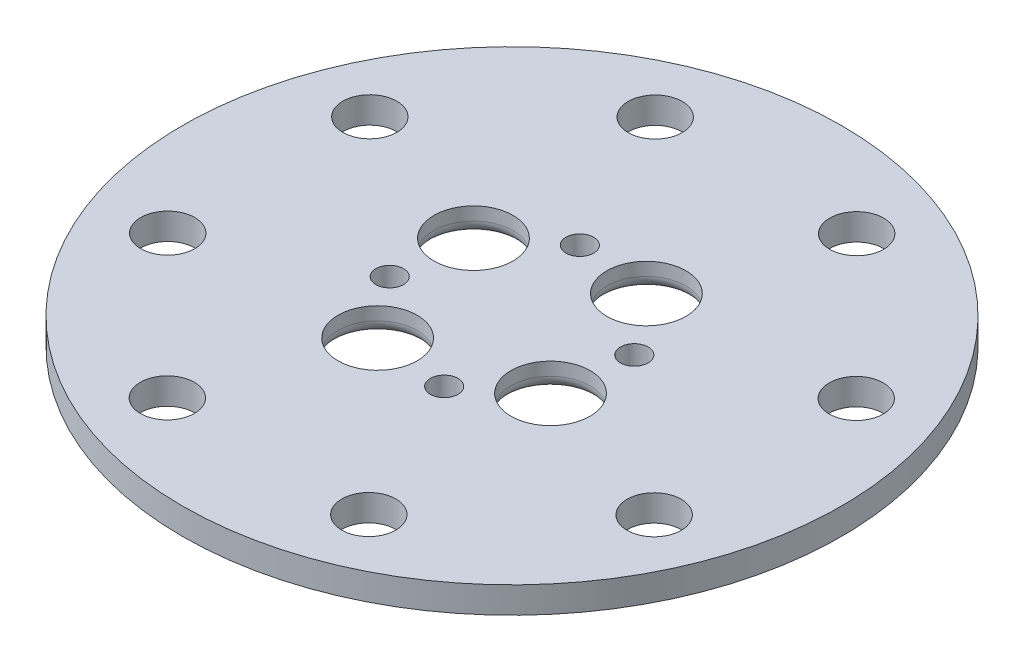
ISO-10303-21;
HEADER;
FILE_DESCRIPTION(('STEP AP214'),'2;1');
FILE_NAME('part.step','',(''),(''),'','','');
FILE_SCHEMA(('AUTOMOTIVE_DESIGN { 1 0 10303 214 1 1 1 1 }'));
ENDSEC;
DATA;
#1=APPLICATION_CONTEXT('core data for automotive mechanical design processes');
#2=APPLICATION_PROTOCOL_DEFINITION('international standard','automotive_design',2000,#1);
#3=PRODUCT_CONTEXT('',#1,'mechanical');
#4=PRODUCT('Part','Part','',(#3));
#5=PRODUCT_RELATED_PRODUCT_CATEGORY('part','',(#4));
#6=PRODUCT_DEFINITION_FORMATION('','',#4);
#7=PRODUCT_DEFINITION_CONTEXT('part definition',#1,'design');
#8=PRODUCT_DEFINITION('design','',#6,#7);
#9=PRODUCT_DEFINITION_SHAPE('','',#8);
#10=(LENGTH_UNIT() NAMED_UNIT(*) SI_UNIT(.MILLI.,.METRE.));
#11=(NAMED_UNIT(*) PLANE_ANGLE_UNIT() SI_UNIT($,.RADIAN.));
#12=(NAMED_UNIT(*) SI_UNIT($,.STERADIAN.) SOLID_ANGLE_UNIT());
#13=UNCERTAINTY_MEASURE_WITH_UNIT(LENGTH_MEASURE(1.E-05),#10,'distance_accuracy_value','');
#14=(GEOMETRIC_REPRESENTATION_CONTEXT(3) GLOBAL_UNCERTAINTY_ASSIGNED_CONTEXT((#13)) GLOBAL_UNIT_ASSIGNED_CONTEXT((#10,
#11,#12)) REPRESENTATION_CONTEXT('',''));
#15=CARTESIAN_POINT('',(0.,0.,0.));
#16=DIRECTION('',(0.,0.,1.));
#17=DIRECTION('',(1.,0.,0.));
#18=AXIS2_PLACEMENT_3D('',#15,#16,#17);
#19=CARTESIAN_POINT('',(0.,2.,0.));
#20=DIRECTION('',(0.,-1.,0.));
#21=DIRECTION('',(0.,0.,-1.));
#22=AXIS2_PLACEMENT_3D('',#19,#20,#21);
#23=CYLINDRICAL_SURFACE('',#22,25.);
#24=CARTESIAN_POINT('',(0.,2.,0.));
#25=DIRECTION('',(0.,1.,0.));
#26=DIRECTION('',(0.,0.,1.));
#27=AXIS2_PLACEMENT_3D('',#24,#25,#26);
#28=CIRCLE('',#27,25.);
#29=CARTESIAN_POINT('',(0.,2.,25.));
#30=VERTEX_POINT('',#29);
#31=EDGE_CURVE('E76',#30,#30,#28,.T.);
#32=ORIENTED_EDGE('',*,*,#31,.F.);
#33=EDGE_LOOP('',(#32));
#34=FACE_BOUND('',#33,.T.);
#35=CARTESIAN_POINT('',(0.,0.,0.));
#36=DIRECTION('',(0.,1.,0.));
#37=DIRECTION('',(0.,0.,1.));
#38=AXIS2_PLACEMENT_3D('',#35,#36,#37);
#39=CIRCLE('',#38,25.);
#40=CARTESIAN_POINT('',(0.,0.,25.));
#41=VERTEX_POINT('',#40);
#42=EDGE_CURVE('E77',#41,#41,#39,.T.);
#43=ORIENTED_EDGE('',*,*,#42,.T.);
#44=EDGE_LOOP('',(#43));
#45=FACE_BOUND('',#44,.T.);
#46=ADVANCED_FACE('F36',(#34,#45),#23,.T.);
#47=CARTESIAN_POINT('',(0.,2.,0.));
#48=DIRECTION('',(0.,1.,0.));
#49=DIRECTION('',(0.,0.,1.));
#50=AXIS2_PLACEMENT_3D('',#47,#48,#49);
#51=PLANE('',#50);
#52=CARTESIAN_POINT('',(-7.68064256948644,2.,18.4663946053315));
#53=DIRECTION('',(0.,-1.,0.));
#54=DIRECTION('',(0.,0.,-1.));
#55=AXIS2_PLACEMENT_3D('',#52,#53,#54);
#56=CIRCLE('',#55,2.05);
#57=CARTESIAN_POINT('',(-7.68064256948644,2.,16.4163946053315));
#58=VERTEX_POINT('',#57);
#59=EDGE_CURVE('E137',#58,#58,#56,.T.);
#60=ORIENTED_EDGE('',*,*,#59,.T.);
#61=EDGE_LOOP('',(#60));
#62=FACE_BOUND('',#61,.T.);
#63=CARTESIAN_POINT('',(7.62667840474221,2.,18.488747294251));
#64=DIRECTION('',(0.,-1.,0.));
#65=DIRECTION('',(0.,0.,-1.));
#66=AXIS2_PLACEMENT_3D('',#63,#64,#65);
#67=CIRCLE('',#66,2.05);
#68=CARTESIAN_POINT('',(7.62667840474221,2.,16.438747294251));
#69=VERTEX_POINT('',#68);
#70=EDGE_CURVE('E162',#69,#69,#67,.T.);
#71=ORIENTED_EDGE('',*,*,#70,.T.);
#72=EDGE_LOOP('',(#71));
#73=FACE_BOUND('',#72,.T.);
#74=CARTESIAN_POINT('',(18.4663946053311,2.,7.68064256948754));
#75=DIRECTION('',(0.,-1.,0.));
#76=DIRECTION('',(0.,0.,-1.));
#77=AXIS2_PLACEMENT_3D('',#74,#75,#76);
#78=CIRCLE('',#77,2.05);
#79=CARTESIAN_POINT('',(18.4663946053311,2.,5.63064256948754));
#80=VERTEX_POINT('',#79);
#81=EDGE_CURVE('E154',#80,#80,#78,.T.);
#82=ORIENTED_EDGE('',*,*,#81,.T.);
#83=EDGE_LOOP('',(#82));
#84=FACE_BOUND('',#83,.T.);
#85=CARTESIAN_POINT('',(18.4887472942505,2.,-7.62667840474111));
#86=DIRECTION('',(0.,-1.,0.));
#87=DIRECTION('',(0.,0.,-1.));
#88=AXIS2_PLACEMENT_3D('',#85,#86,#87);
#89=CIRCLE('',#88,2.05);
#90=CARTESIAN_POINT('',(18.4887472942505,2.,-9.67667840474111));
#91=VERTEX_POINT('',#90);
#92=EDGE_CURVE('E145',#91,#91,#89,.T.);
#93=ORIENTED_EDGE('',*,*,#92,.T.);
#94=EDGE_LOOP('',(#93));
#95=FACE_BOUND('',#94,.T.);
#96=CARTESIAN_POINT('',(7.6806425694871,2.,-18.46639460533));
#97=DIRECTION('',(0.,-1.,0.));
#98=DIRECTION('',(0.,0.,-1.));
#99=AXIS2_PLACEMENT_3D('',#96,#97,#98);
#100=CIRCLE('',#99,2.05);
#101=CARTESIAN_POINT('',(7.6806425694871,2.,-20.51639460533));
#102=VERTEX_POINT('',#101);
#103=EDGE_CURVE('E146',#102,#102,#100,.T.);
#104=ORIENTED_EDGE('',*,*,#103,.T.);
#105=EDGE_LOOP('',(#104));
#106=FACE_BOUND('',#105,.T.);
#107=CARTESIAN_POINT('',(-7.62667840474155,2.,-18.4887472942494));
#108=DIRECTION('',(0.,-1.,0.));
#109=DIRECTION('',(0.,0.,-1.));
#110=AXIS2_PLACEMENT_3D('',#107,#108,#109);
#111=CIRCLE('',#110,2.05);
#112=CARTESIAN_POINT('',(-7.62667840474155,2.,-20.5387472942494));
#113=VERTEX_POINT('',#112);
#114=EDGE_CURVE('E185',#113,#113,#111,.T.);
#115=ORIENTED_EDGE('',*,*,#114,.T.);
#116=EDGE_LOOP('',(#115));
#117=FACE_BOUND('',#116,.T.);
#118=CARTESIAN_POINT('',(-18.4663946053304,2.,-7.68064256948599));
#119=DIRECTION('',(0.,-1.,0.));
#120=DIRECTION('',(0.,0.,-1.));
#121=AXIS2_PLACEMENT_3D('',#118,#119,#120);
#122=CIRCLE('',#121,2.05);
#123=CARTESIAN_POINT('',(-18.4663946053304,2.,-9.73064256948599));
#124=VERTEX_POINT('',#123);
#125=EDGE_CURVE('E177',#124,#124,#122,.T.);
#126=ORIENTED_EDGE('',*,*,#125,.T.);
#127=EDGE_LOOP('',(#126));
#128=FACE_BOUND('',#127,.T.);
#129=CARTESIAN_POINT('',(-18.4887472942499,2.,7.62667840474266));
#130=DIRECTION('',(0.,-1.,0.));
#131=DIRECTION('',(0.,0.,-1.));
#132=AXIS2_PLACEMENT_3D('',#129,#130,#131);
#133=CIRCLE('',#132,2.05);
#134=CARTESIAN_POINT('',(-18.4887472942499,2.,5.57667840474266));
#135=VERTEX_POINT('',#134);
#136=EDGE_CURVE('E126',#135,#135,#133,.T.);
#137=ORIENTED_EDGE('',*,*,#136,.T.);
#138=EDGE_LOOP('',(#137));
#139=FACE_BOUND('',#138,.T.);
#140=CARTESIAN_POINT('',(-7.20972393812874,2.,2.06636897382066));
#141=DIRECTION('',(0.,1.,0.));
#142=DIRECTION('',(0.,0.,1.));
#143=AXIS2_PLACEMENT_3D('',#140,#141,#142);
#144=CIRCLE('',#143,1.05);
#145=CARTESIAN_POINT('',(-7.20972393812874,2.,3.11636897382066));
#146=VERTEX_POINT('',#145);
#147=EDGE_CURVE('E105',#146,#146,#144,.T.);
#148=ORIENTED_EDGE('',*,*,#147,.F.);
#149=EDGE_LOOP('',(#148));
#150=FACE_BOUND('',#149,.T.);
#151=CARTESIAN_POINT('',(2.06636897382105,2.,7.20972393812896));
#152=DIRECTION('',(0.,1.,0.));
#153=DIRECTION('',(0.,0.,1.));
#154=AXIS2_PLACEMENT_3D('',#151,#152,#153);
#155=CIRCLE('',#154,1.05);
#156=CARTESIAN_POINT('',(2.06636897382105,2.,8.25972393812896));
#157=VERTEX_POINT('',#156);
#158=EDGE_CURVE('E114',#157,#157,#155,.T.);
#159=ORIENTED_EDGE('',*,*,#158,.F.);
#160=EDGE_LOOP('',(#159));
#161=FACE_BOUND('',#160,.T.);
#162=CARTESIAN_POINT('',(7.20972393812935,2.,-2.06636897382083));
#163=DIRECTION('',(0.,1.,0.));
#164=DIRECTION('',(0.,0.,1.));
#165=AXIS2_PLACEMENT_3D('',#162,#163,#164);
#166=CIRCLE('',#165,1.05);
#167=CARTESIAN_POINT('',(7.20972393812935,2.,-1.01636897382083));
#168=VERTEX_POINT('',#167);
#169=EDGE_CURVE('E93',#168,#168,#166,.T.);
#170=ORIENTED_EDGE('',*,*,#169,.F.);
#171=EDGE_LOOP('',(#170));
#172=FACE_BOUND('',#171,.T.);
#173=CARTESIAN_POINT('',(-3.63690117331162,2.,6.55918820095631));
#174=DIRECTION('',(0.,1.,0.));
#175=DIRECTION('',(0.,0.,1.));
#176=AXIS2_PLACEMENT_3D('',#173,#174,#175);
#177=CIRCLE('',#176,3.);
#178=CARTESIAN_POINT('',(-3.63690117331162,2.,9.55918820095631));
#179=VERTEX_POINT('',#178);
#180=EDGE_CURVE('E89',#179,#179,#177,.T.);
#181=ORIENTED_EDGE('',*,*,#180,.F.);
#182=EDGE_LOOP('',(#181));
#183=FACE_BOUND('',#182,.T.);
#184=CARTESIAN_POINT('',(-6.5591882009563,2.,-3.63690117331165));
#185=DIRECTION('',(0.,1.,0.));
#186=DIRECTION('',(0.,0.,1.));
#187=AXIS2_PLACEMENT_3D('',#184,#185,#186);
#188=CIRCLE('',#187,3.);
#189=CARTESIAN_POINT('',(-6.5591882009563,2.,-0.636901173311649));
#190=VERTEX_POINT('',#189);
#191=EDGE_CURVE('E110',#190,#190,#188,.T.);
#192=ORIENTED_EDGE('',*,*,#191,.F.);
#193=EDGE_LOOP('',(#192));
#194=FACE_BOUND('',#193,.T.);
#195=CARTESIAN_POINT('',(3.63690117331167,2.,-6.55918820095629));
#196=DIRECTION('',(0.,1.,0.));
#197=DIRECTION('',(0.,0.,1.));
#198=AXIS2_PLACEMENT_3D('',#195,#196,#197);
#199=CIRCLE('',#198,3.);
#200=CARTESIAN_POINT('',(3.63690117331167,2.,-3.55918820095629));
#201=VERTEX_POINT('',#200);
#202=EDGE_CURVE('E125',#201,#201,#199,.T.);
#203=ORIENTED_EDGE('',*,*,#202,.F.);
#204=EDGE_LOOP('',(#203));
#205=FACE_BOUND('',#204,.T.);
#206=CARTESIAN_POINT('',(6.55918820095628,2.,3.63690117331169));
#207=DIRECTION('',(0.,1.,0.));
#208=DIRECTION('',(0.,0.,1.));
#209=AXIS2_PLACEMENT_3D('',#206,#207,#208);
#210=CIRCLE('',#209,3.);
#211=CARTESIAN_POINT('',(6.55918820095628,2.,6.63690117331169));
#212=VERTEX_POINT('',#211);
#213=EDGE_CURVE('E121',#212,#212,#210,.T.);
#214=ORIENTED_EDGE('',*,*,#213,.F.);
#215=EDGE_LOOP('',(#214));
#216=FACE_BOUND('',#215,.T.);
#217=CARTESIAN_POINT('',(-2.06636897382044,2.,-7.20972393812913));
#218=DIRECTION('',(0.,1.,0.));
#219=DIRECTION('',(0.,0.,1.));
#220=AXIS2_PLACEMENT_3D('',#217,#218,#219);
#221=CIRCLE('',#220,1.05);
#222=CARTESIAN_POINT('',(-2.06636897382044,2.,-6.15972393812913));
#223=VERTEX_POINT('',#222);
#224=EDGE_CURVE('E85',#223,#223,#221,.T.);
#225=ORIENTED_EDGE('',*,*,#224,.F.);
#226=EDGE_LOOP('',(#225));
#227=FACE_BOUND('',#226,.T.);
#228=ORIENTED_EDGE('',*,*,#31,.T.);
#229=EDGE_LOOP('',(#228));
#230=FACE_BOUND('',#229,.T.);
#231=ADVANCED_FACE('F197',(#62,#73,#84,#95,#106,#117,#128,#139,#150,#161,#172,#183,#194,#205,
#216,#227,#230),#51,.T.);
#232=CARTESIAN_POINT('',(0.,0.,0.));
#233=DIRECTION('',(0.,1.,0.));
#234=DIRECTION('',(0.,0.,1.));
#235=AXIS2_PLACEMENT_3D('',#232,#233,#234);
#236=PLANE('',#235);
#237=CARTESIAN_POINT('',(-7.68064256948644,0.,18.4663946053315));
#238=DIRECTION('',(0.,-1.,0.));
#239=DIRECTION('',(0.,0.,-1.));
#240=AXIS2_PLACEMENT_3D('',#237,#238,#239);
#241=CIRCLE('',#240,2.05);
#242=CARTESIAN_POINT('',(-7.68064256948644,0.,16.4163946053315));
#243=VERTEX_POINT('',#242);
#244=EDGE_CURVE('E166',#243,#243,#241,.T.);
#245=ORIENTED_EDGE('',*,*,#244,.F.);
#246=EDGE_LOOP('',(#245));
#247=FACE_BOUND('',#246,.T.);
#248=CARTESIAN_POINT('',(7.62667840474221,0.,18.488747294251));
#249=DIRECTION('',(0.,-1.,0.));
#250=DIRECTION('',(0.,0.,-1.));
#251=AXIS2_PLACEMENT_3D('',#248,#249,#250);
#252=CIRCLE('',#251,2.05);
#253=CARTESIAN_POINT('',(7.62667840474221,0.,16.438747294251));
#254=VERTEX_POINT('',#253);
#255=EDGE_CURVE('E158',#254,#254,#252,.T.);
#256=ORIENTED_EDGE('',*,*,#255,.F.);
#257=EDGE_LOOP('',(#256));
#258=FACE_BOUND('',#257,.T.);
#259=CARTESIAN_POINT('',(18.4663946053311,0.,7.68064256948754));
#260=DIRECTION('',(0.,-1.,0.));
#261=DIRECTION('',(0.,0.,-1.));
#262=AXIS2_PLACEMENT_3D('',#259,#260,#261);
#263=CIRCLE('',#262,2.05);
#264=CARTESIAN_POINT('',(18.4663946053311,0.,5.63064256948754));
#265=VERTEX_POINT('',#264);
#266=EDGE_CURVE('E150',#265,#265,#263,.T.);
#267=ORIENTED_EDGE('',*,*,#266,.F.);
#268=EDGE_LOOP('',(#267));
#269=FACE_BOUND('',#268,.T.);
#270=CARTESIAN_POINT('',(18.4887472942505,0.,-7.62667840474111));
#271=DIRECTION('',(0.,-1.,0.));
#272=DIRECTION('',(0.,0.,-1.));
#273=AXIS2_PLACEMENT_3D('',#270,#271,#272);
#274=CIRCLE('',#273,2.05);
#275=CARTESIAN_POINT('',(18.4887472942505,0.,-9.67667840474111));
#276=VERTEX_POINT('',#275);
#277=EDGE_CURVE('E141',#276,#276,#274,.T.);
#278=ORIENTED_EDGE('',*,*,#277,.F.);
#279=EDGE_LOOP('',(#278));
#280=FACE_BOUND('',#279,.T.);
#281=CARTESIAN_POINT('',(7.6806425694871,0.,-18.46639460533));
#282=DIRECTION('',(0.,-1.,0.));
#283=DIRECTION('',(0.,0.,-1.));
#284=AXIS2_PLACEMENT_3D('',#281,#282,#283);
#285=CIRCLE('',#284,2.05);
#286=CARTESIAN_POINT('',(7.6806425694871,0.,-20.51639460533));
#287=VERTEX_POINT('',#286);
#288=EDGE_CURVE('E189',#287,#287,#285,.T.);
#289=ORIENTED_EDGE('',*,*,#288,.F.);
#290=EDGE_LOOP('',(#289));
#291=FACE_BOUND('',#290,.T.);
#292=CARTESIAN_POINT('',(-7.62667840474155,0.,-18.4887472942494));
#293=DIRECTION('',(0.,-1.,0.));
#294=DIRECTION('',(0.,0.,-1.));
#295=AXIS2_PLACEMENT_3D('',#292,#293,#294);
#296=CIRCLE('',#295,2.05);
#297=CARTESIAN_POINT('',(-7.62667840474155,0.,-20.5387472942494));
#298=VERTEX_POINT('',#297);
#299=EDGE_CURVE('E181',#298,#298,#296,.T.);
#300=ORIENTED_EDGE('',*,*,#299,.F.);
#301=EDGE_LOOP('',(#300));
#302=FACE_BOUND('',#301,.T.);
#303=CARTESIAN_POINT('',(-18.4663946053304,0.,-7.68064256948599));
#304=DIRECTION('',(0.,-1.,0.));
#305=DIRECTION('',(0.,0.,-1.));
#306=AXIS2_PLACEMENT_3D('',#303,#304,#305);
#307=CIRCLE('',#306,2.05);
#308=CARTESIAN_POINT('',(-18.4663946053304,0.,-9.73064256948599));
#309=VERTEX_POINT('',#308);
#310=EDGE_CURVE('E173',#309,#309,#307,.T.);
#311=ORIENTED_EDGE('',*,*,#310,.F.);
#312=EDGE_LOOP('',(#311));
#313=FACE_BOUND('',#312,.T.);
#314=CARTESIAN_POINT('',(-18.4887472942499,0.,7.62667840474266));
#315=DIRECTION('',(0.,-1.,0.));
#316=DIRECTION('',(0.,0.,-1.));
#317=AXIS2_PLACEMENT_3D('',#314,#315,#316);
#318=CIRCLE('',#317,2.05);
#319=CARTESIAN_POINT('',(-18.4887472942499,0.,5.57667840474266));
#320=VERTEX_POINT('',#319);
#321=EDGE_CURVE('E133',#320,#320,#318,.T.);
#322=ORIENTED_EDGE('',*,*,#321,.F.);
#323=EDGE_LOOP('',(#322));
#324=FACE_BOUND('',#323,.T.);
#325=CARTESIAN_POINT('',(-6.5591882009563,0.,-3.63690117331165));
#326=DIRECTION('',(0.,1.,0.));
#327=DIRECTION('',(0.,0.,1.));
#328=AXIS2_PLACEMENT_3D('',#325,#326,#327);
#329=CIRCLE('',#328,4.);
#330=CARTESIAN_POINT('',(-6.5591882009563,0.,0.363098826688352));
#331=VERTEX_POINT('',#330);
#332=EDGE_CURVE('E60',#331,#331,#329,.T.);
#333=ORIENTED_EDGE('',*,*,#332,.T.);
#334=EDGE_LOOP('',(#333));
#335=FACE_BOUND('',#334,.T.);
#336=CARTESIAN_POINT('',(3.63690117331167,0.,-6.55918820095629));
#337=DIRECTION('',(0.,1.,0.));
#338=DIRECTION('',(0.,0.,1.));
#339=AXIS2_PLACEMENT_3D('',#336,#337,#338);
#340=CIRCLE('',#339,4.);
#341=CARTESIAN_POINT('',(3.63690117331167,0.,-2.55918820095629));
#342=VERTEX_POINT('',#341);
#343=EDGE_CURVE('E64',#342,#342,#340,.T.);
#344=ORIENTED_EDGE('',*,*,#343,.T.);
#345=EDGE_LOOP('',(#344));
#346=FACE_BOUND('',#345,.T.);
#347=CARTESIAN_POINT('',(6.55918820095628,0.,3.63690117331169));
#348=DIRECTION('',(0.,1.,0.));
#349=DIRECTION('',(0.,0.,1.));
#350=AXIS2_PLACEMENT_3D('',#347,#348,#349);
#351=CIRCLE('',#350,4.);
#352=CARTESIAN_POINT('',(6.55918820095628,0.,7.63690117331169));
#353=VERTEX_POINT('',#352);
#354=EDGE_CURVE('E68',#353,#353,#351,.T.);
#355=ORIENTED_EDGE('',*,*,#354,.T.);
#356=EDGE_LOOP('',(#355));
#357=FACE_BOUND('',#356,.T.);
#358=CARTESIAN_POINT('',(-3.63690117331162,0.,6.55918820095631));
#359=DIRECTION('',(0.,1.,0.));
#360=DIRECTION('',(0.,0.,1.));
#361=AXIS2_PLACEMENT_3D('',#358,#359,#360);
#362=CIRCLE('',#361,4.);
#363=CARTESIAN_POINT('',(-3.63690117331162,0.,10.5591882009563));
#364=VERTEX_POINT('',#363);
#365=EDGE_CURVE('E72',#364,#364,#362,.T.);
#366=ORIENTED_EDGE('',*,*,#365,.T.);
#367=EDGE_LOOP('',(#366));
#368=FACE_BOUND('',#367,.T.);
#369=CARTESIAN_POINT('',(-7.20972393812874,0.,2.06636897382066));
#370=DIRECTION('',(0.,1.,0.));
#371=DIRECTION('',(0.,0.,1.));
#372=AXIS2_PLACEMENT_3D('',#369,#370,#371);
#373=CIRCLE('',#372,1.05);
#374=CARTESIAN_POINT('',(-7.20972393812874,0.,3.11636897382066));
#375=VERTEX_POINT('',#374);
#376=EDGE_CURVE('E109',#375,#375,#373,.T.);
#377=ORIENTED_EDGE('',*,*,#376,.T.);
#378=EDGE_LOOP('',(#377));
#379=FACE_BOUND('',#378,.T.);
#380=CARTESIAN_POINT('',(2.06636897382105,0.,7.20972393812896));
#381=DIRECTION('',(0.,1.,0.));
#382=DIRECTION('',(0.,0.,1.));
#383=AXIS2_PLACEMENT_3D('',#380,#381,#382);
#384=CIRCLE('',#383,1.05);
#385=CARTESIAN_POINT('',(2.06636897382105,0.,8.25972393812896));
#386=VERTEX_POINT('',#385);
#387=EDGE_CURVE('E98',#386,#386,#384,.T.);
#388=ORIENTED_EDGE('',*,*,#387,.T.);
#389=EDGE_LOOP('',(#388));
#390=FACE_BOUND('',#389,.T.);
#391=CARTESIAN_POINT('',(7.20972393812935,0.,-2.06636897382083));
#392=DIRECTION('',(0.,1.,0.));
#393=DIRECTION('',(0.,0.,1.));
#394=AXIS2_PLACEMENT_3D('',#391,#392,#393);
#395=CIRCLE('',#394,1.05);
#396=CARTESIAN_POINT('',(7.20972393812935,0.,-1.01636897382083));
#397=VERTEX_POINT('',#396);
#398=EDGE_CURVE('E97',#397,#397,#395,.T.);
#399=ORIENTED_EDGE('',*,*,#398,.T.);
#400=EDGE_LOOP('',(#399));
#401=FACE_BOUND('',#400,.T.);
#402=CARTESIAN_POINT('',(-2.06636897382044,0.,-7.20972393812913));
#403=DIRECTION('',(0.,1.,0.));
#404=DIRECTION('',(0.,0.,1.));
#405=AXIS2_PLACEMENT_3D('',#402,#403,#404);
#406=CIRCLE('',#405,1.05);
#407=CARTESIAN_POINT('',(-2.06636897382044,0.,-6.15972393812913));
#408=VERTEX_POINT('',#407);
#409=EDGE_CURVE('E81',#408,#408,#406,.T.);
#410=ORIENTED_EDGE('',*,*,#409,.T.);
#411=EDGE_LOOP('',(#410));
#412=FACE_BOUND('',#411,.T.);
#413=ORIENTED_EDGE('',*,*,#42,.F.);
#414=EDGE_LOOP('',(#413));
#415=FACE_BOUND('',#414,.T.);
#416=ADVANCED_FACE('F208',(#247,#258,#269,#280,#291,#302,#313,#324,#335,#346,#357,#368,#379,
#390,#401,#412,#415),#236,.F.);
#417=CARTESIAN_POINT('',(-2.06636897382044,0.,-7.20972393812913));
#418=DIRECTION('',(0.,1.,0.));
#419=DIRECTION('',(0.,0.,1.));
#420=AXIS2_PLACEMENT_3D('',#417,#418,#419);
#421=CYLINDRICAL_SURFACE('',#420,1.05);
#422=ORIENTED_EDGE('',*,*,#409,.F.);
#423=EDGE_LOOP('',(#422));
#424=FACE_BOUND('',#423,.T.);
#425=ORIENTED_EDGE('',*,*,#224,.T.);
#426=EDGE_LOOP('',(#425));
#427=FACE_BOUND('',#426,.T.);
#428=ADVANCED_FACE('F211',(#424,#427),#421,.F.);
#429=CARTESIAN_POINT('',(6.55918820095628,0.,3.63690117331169));
#430=DIRECTION('',(0.,1.,0.));
#431=DIRECTION('',(0.,0.,1.));
#432=AXIS2_PLACEMENT_3D('',#429,#430,#431);
#433=CYLINDRICAL_SURFACE('',#432,3.);
#434=CARTESIAN_POINT('',(6.55918820095628,1.,3.63690117331169));
#435=DIRECTION('',(0.,1.,0.));
#436=DIRECTION('',(0.,0.,1.));
#437=AXIS2_PLACEMENT_3D('',#434,#435,#436);
#438=CIRCLE('',#437,3.);
#439=CARTESIAN_POINT('',(6.55918820095628,1.,6.63690117331169));
#440=VERTEX_POINT('',#439);
#441=EDGE_CURVE('E44',#440,#440,#438,.F.);
#442=ORIENTED_EDGE('',*,*,#441,.T.);
#443=EDGE_LOOP('',(#442));
#444=FACE_BOUND('',#443,.T.);
#445=ORIENTED_EDGE('',*,*,#213,.T.);
#446=EDGE_LOOP('',(#445));
#447=FACE_BOUND('',#446,.T.);
#448=ADVANCED_FACE('F291',(#444,#447),#433,.F.);
#449=CARTESIAN_POINT('',(3.63690117331167,0.,-6.55918820095629));
#450=DIRECTION('',(0.,1.,0.));
#451=DIRECTION('',(0.,0.,1.));
#452=AXIS2_PLACEMENT_3D('',#449,#450,#451);
#453=CYLINDRICAL_SURFACE('',#452,3.);
#454=CARTESIAN_POINT('',(3.63690117331167,1.,-6.55918820095629));
#455=DIRECTION('',(0.,1.,0.));
#456=DIRECTION('',(0.,0.,1.));
#457=AXIS2_PLACEMENT_3D('',#454,#455,#456);
#458=CIRCLE('',#457,3.);
#459=CARTESIAN_POINT('',(3.63690117331167,1.,-3.55918820095629));
#460=VERTEX_POINT('',#459);
#461=EDGE_CURVE('E49',#460,#460,#458,.F.);
#462=ORIENTED_EDGE('',*,*,#461,.T.);
#463=EDGE_LOOP('',(#462));
#464=FACE_BOUND('',#463,.T.);
#465=ORIENTED_EDGE('',*,*,#202,.T.);
#466=EDGE_LOOP('',(#465));
#467=FACE_BOUND('',#466,.T.);
#468=ADVANCED_FACE('F287',(#464,#467),#453,.F.);
#469=CARTESIAN_POINT('',(-6.5591882009563,0.,-3.63690117331165));
#470=DIRECTION('',(0.,1.,0.));
#471=DIRECTION('',(0.,0.,1.));
#472=AXIS2_PLACEMENT_3D('',#469,#470,#471);
#473=CYLINDRICAL_SURFACE('',#472,3.);
#474=CARTESIAN_POINT('',(-6.5591882009563,1.,-3.63690117331165));
#475=DIRECTION('',(0.,1.,0.));
#476=DIRECTION('',(0.,0.,1.));
#477=AXIS2_PLACEMENT_3D('',#474,#475,#476);
#478=CIRCLE('',#477,3.);
#479=CARTESIAN_POINT('',(-6.5591882009563,1.,-0.636901173311649));
#480=VERTEX_POINT('',#479);
#481=EDGE_CURVE('E54',#480,#480,#478,.F.);
#482=ORIENTED_EDGE('',*,*,#481,.T.);
#483=EDGE_LOOP('',(#482));
#484=FACE_BOUND('',#483,.T.);
#485=ORIENTED_EDGE('',*,*,#191,.T.);
#486=EDGE_LOOP('',(#485));
#487=FACE_BOUND('',#486,.T.);
#488=ADVANCED_FACE('F283',(#484,#487),#473,.F.);
#489=CARTESIAN_POINT('',(-3.63690117331162,0.,6.55918820095631));
#490=DIRECTION('',(0.,1.,0.));
#491=DIRECTION('',(0.,0.,1.));
#492=AXIS2_PLACEMENT_3D('',#489,#490,#491);
#493=CYLINDRICAL_SURFACE('',#492,3.);
#494=CARTESIAN_POINT('',(-3.63690117331162,1.,6.55918820095631));
#495=DIRECTION('',(0.,1.,0.));
#496=DIRECTION('',(0.,0.,1.));
#497=AXIS2_PLACEMENT_3D('',#494,#495,#496);
#498=CIRCLE('',#497,3.);
#499=CARTESIAN_POINT('',(-3.63690117331162,1.,9.55918820095631));
#500=VERTEX_POINT('',#499);
#501=EDGE_CURVE('E10',#500,#500,#498,.F.);
#502=ORIENTED_EDGE('',*,*,#501,.T.);
#503=EDGE_LOOP('',(#502));
#504=FACE_BOUND('',#503,.T.);
#505=ORIENTED_EDGE('',*,*,#180,.T.);
#506=EDGE_LOOP('',(#505));
#507=FACE_BOUND('',#506,.T.);
#508=ADVANCED_FACE('F286',(#504,#507),#493,.F.);
#509=CARTESIAN_POINT('',(7.20972393812935,0.,-2.06636897382083));
#510=DIRECTION('',(0.,1.,0.));
#511=DIRECTION('',(0.,0.,1.));
#512=AXIS2_PLACEMENT_3D('',#509,#510,#511);
#513=CYLINDRICAL_SURFACE('',#512,1.05);
#514=ORIENTED_EDGE('',*,*,#398,.F.);
#515=EDGE_LOOP('',(#514));
#516=FACE_BOUND('',#515,.T.);
#517=ORIENTED_EDGE('',*,*,#169,.T.);
#518=EDGE_LOOP('',(#517));
#519=FACE_BOUND('',#518,.T.);
#520=ADVANCED_FACE('F298',(#516,#519),#513,.F.);
#521=CARTESIAN_POINT('',(2.06636897382105,0.,7.20972393812896));
#522=DIRECTION('',(0.,1.,0.));
#523=DIRECTION('',(0.,0.,1.));
#524=AXIS2_PLACEMENT_3D('',#521,#522,#523);
#525=CYLINDRICAL_SURFACE('',#524,1.05);
#526=ORIENTED_EDGE('',*,*,#387,.F.);
#527=EDGE_LOOP('',(#526));
#528=FACE_BOUND('',#527,.T.);
#529=ORIENTED_EDGE('',*,*,#158,.T.);
#530=EDGE_LOOP('',(#529));
#531=FACE_BOUND('',#530,.T.);
#532=ADVANCED_FACE('F295',(#528,#531),#525,.F.);
#533=CARTESIAN_POINT('',(-7.20972393812874,0.,2.06636897382066));
#534=DIRECTION('',(0.,1.,0.));
#535=DIRECTION('',(0.,0.,1.));
#536=AXIS2_PLACEMENT_3D('',#533,#534,#535);
#537=CYLINDRICAL_SURFACE('',#536,1.05);
#538=ORIENTED_EDGE('',*,*,#376,.F.);
#539=EDGE_LOOP('',(#538));
#540=FACE_BOUND('',#539,.T.);
#541=ORIENTED_EDGE('',*,*,#147,.T.);
#542=EDGE_LOOP('',(#541));
#543=FACE_BOUND('',#542,.T.);
#544=ADVANCED_FACE('F253',(#540,#543),#537,.F.);
#545=CARTESIAN_POINT('',(-6.5591882009563,1.,-3.63690117331165));
#546=DIRECTION('',(0.,1.,0.));
#547=DIRECTION('',(0.,0.,1.));
#548=AXIS2_PLACEMENT_3D('',#545,#546,#547);
#549=TOROIDAL_SURFACE('',#548,4.,1.);
#550=ORIENTED_EDGE('',*,*,#481,.F.);
#551=EDGE_LOOP('',(#550));
#552=FACE_BOUND('',#551,.T.);
#553=ORIENTED_EDGE('',*,*,#332,.F.);
#554=EDGE_LOOP('',(#553));
#555=FACE_BOUND('',#554,.T.);
#556=ADVANCED_FACE('F249',(#552,#555),#549,.T.);
#557=CARTESIAN_POINT('',(3.63690117331167,1.,-6.55918820095629));
#558=DIRECTION('',(0.,1.,0.));
#559=DIRECTION('',(0.,0.,1.));
#560=AXIS2_PLACEMENT_3D('',#557,#558,#559);
#561=TOROIDAL_SURFACE('',#560,4.,1.);
#562=ORIENTED_EDGE('',*,*,#461,.F.);
#563=EDGE_LOOP('',(#562));
#564=FACE_BOUND('',#563,.T.);
#565=ORIENTED_EDGE('',*,*,#343,.F.);
#566=EDGE_LOOP('',(#565));
#567=FACE_BOUND('',#566,.T.);
#568=ADVANCED_FACE('F252',(#564,#567),#561,.T.);
#569=CARTESIAN_POINT('',(6.55918820095628,1.,3.63690117331169));
#570=DIRECTION('',(0.,1.,0.));
#571=DIRECTION('',(0.,0.,1.));
#572=AXIS2_PLACEMENT_3D('',#569,#570,#571);
#573=TOROIDAL_SURFACE('',#572,4.,1.);
#574=ORIENTED_EDGE('',*,*,#441,.F.);
#575=EDGE_LOOP('',(#574));
#576=FACE_BOUND('',#575,.T.);
#577=ORIENTED_EDGE('',*,*,#354,.F.);
#578=EDGE_LOOP('',(#577));
#579=FACE_BOUND('',#578,.T.);
#580=ADVANCED_FACE('F256',(#576,#579),#573,.T.);
#581=CARTESIAN_POINT('',(-3.63690117331162,1.,6.55918820095631));
#582=DIRECTION('',(0.,1.,0.));
#583=DIRECTION('',(0.,0.,1.));
#584=AXIS2_PLACEMENT_3D('',#581,#582,#583);
#585=TOROIDAL_SURFACE('',#584,4.,1.);
#586=ORIENTED_EDGE('',*,*,#501,.F.);
#587=EDGE_LOOP('',(#586));
#588=FACE_BOUND('',#587,.T.);
#589=ORIENTED_EDGE('',*,*,#365,.F.);
#590=EDGE_LOOP('',(#589));
#591=FACE_BOUND('',#590,.T.);
#592=ADVANCED_FACE('F38',(#588,#591),#585,.T.);
#593=CARTESIAN_POINT('',(-18.4887472942499,2.,7.62667840474266));
#594=DIRECTION('',(0.,-1.,0.));
#595=DIRECTION('',(0.,0.,-1.));
#596=AXIS2_PLACEMENT_3D('',#593,#594,#595);
#597=CYLINDRICAL_SURFACE('',#596,2.05);
#598=ORIENTED_EDGE('',*,*,#136,.F.);
#599=EDGE_LOOP('',(#598));
#600=FACE_BOUND('',#599,.T.);
#601=ORIENTED_EDGE('',*,*,#321,.T.);
#602=EDGE_LOOP('',(#601));
#603=FACE_BOUND('',#602,.T.);
#604=ADVANCED_FACE('F263',(#600,#603),#597,.F.);
#605=CARTESIAN_POINT('',(-18.4663946053304,2.,-7.68064256948599));
#606=DIRECTION('',(0.,-1.,0.));
#607=DIRECTION('',(0.,0.,-1.));
#608=AXIS2_PLACEMENT_3D('',#605,#606,#607);
#609=CYLINDRICAL_SURFACE('',#608,2.05);
#610=ORIENTED_EDGE('',*,*,#125,.F.);
#611=EDGE_LOOP('',(#610));
#612=FACE_BOUND('',#611,.T.);
#613=ORIENTED_EDGE('',*,*,#310,.T.);
#614=EDGE_LOOP('',(#613));
#615=FACE_BOUND('',#614,.T.);
#616=ADVANCED_FACE('F269',(#612,#615),#609,.F.);
#617=CARTESIAN_POINT('',(-7.62667840474155,2.,-18.4887472942494));
#618=DIRECTION('',(0.,-1.,0.));
#619=DIRECTION('',(0.,0.,-1.));
#620=AXIS2_PLACEMENT_3D('',#617,#618,#619);
#621=CYLINDRICAL_SURFACE('',#620,2.05);
#622=ORIENTED_EDGE('',*,*,#114,.F.);
#623=EDGE_LOOP('',(#622));
#624=FACE_BOUND('',#623,.T.);
#625=ORIENTED_EDGE('',*,*,#299,.T.);
#626=EDGE_LOOP('',(#625));
#627=FACE_BOUND('',#626,.T.);
#628=ADVANCED_FACE('F204',(#624,#627),#621,.F.);
#629=CARTESIAN_POINT('',(7.6806425694871,2.,-18.46639460533));
#630=DIRECTION('',(0.,-1.,0.));
#631=DIRECTION('',(0.,0.,-1.));
#632=AXIS2_PLACEMENT_3D('',#629,#630,#631);
#633=CYLINDRICAL_SURFACE('',#632,2.05);
#634=ORIENTED_EDGE('',*,*,#103,.F.);
#635=EDGE_LOOP('',(#634));
#636=FACE_BOUND('',#635,.T.);
#637=ORIENTED_EDGE('',*,*,#288,.T.);
#638=EDGE_LOOP('',(#637));
#639=FACE_BOUND('',#638,.T.);
#640=ADVANCED_FACE('F200',(#636,#639),#633,.F.);
#641=CARTESIAN_POINT('',(18.4887472942505,2.,-7.62667840474111));
#642=DIRECTION('',(0.,-1.,0.));
#643=DIRECTION('',(0.,0.,-1.));
#644=AXIS2_PLACEMENT_3D('',#641,#642,#643);
#645=CYLINDRICAL_SURFACE('',#644,2.05);
#646=ORIENTED_EDGE('',*,*,#92,.F.);
#647=EDGE_LOOP('',(#646));
#648=FACE_BOUND('',#647,.T.);
#649=ORIENTED_EDGE('',*,*,#277,.T.);
#650=EDGE_LOOP('',(#649));
#651=FACE_BOUND('',#650,.T.);
#652=ADVANCED_FACE('F203',(#648,#651),#645,.F.);
#653=CARTESIAN_POINT('',(18.4663946053311,2.,7.68064256948754));
#654=DIRECTION('',(0.,-1.,0.));
#655=DIRECTION('',(0.,0.,-1.));
#656=AXIS2_PLACEMENT_3D('',#653,#654,#655);
#657=CYLINDRICAL_SURFACE('',#656,2.05);
#658=ORIENTED_EDGE('',*,*,#81,.F.);
#659=EDGE_LOOP('',(#658));
#660=FACE_BOUND('',#659,.T.);
#661=ORIENTED_EDGE('',*,*,#266,.T.);
#662=EDGE_LOOP('',(#661));
#663=FACE_BOUND('',#662,.T.);
#664=ADVANCED_FACE('F409',(#660,#663),#657,.F.);
#665=CARTESIAN_POINT('',(7.62667840474221,2.,18.488747294251));
#666=DIRECTION('',(0.,-1.,0.));
#667=DIRECTION('',(0.,0.,-1.));
#668=AXIS2_PLACEMENT_3D('',#665,#666,#667);
#669=CYLINDRICAL_SURFACE('',#668,2.05);
#670=ORIENTED_EDGE('',*,*,#70,.F.);
#671=EDGE_LOOP('',(#670));
#672=FACE_BOUND('',#671,.T.);
#673=ORIENTED_EDGE('',*,*,#255,.T.);
#674=EDGE_LOOP('',(#673));
#675=FACE_BOUND('',#674,.T.);
#676=ADVANCED_FACE('F418',(#672,#675),#669,.F.);
#677=CARTESIAN_POINT('',(-7.68064256948644,2.,18.4663946053315));
#678=DIRECTION('',(0.,-1.,0.));
#679=DIRECTION('',(0.,0.,-1.));
#680=AXIS2_PLACEMENT_3D('',#677,#678,#679);
#681=CYLINDRICAL_SURFACE('',#680,2.05);
#682=ORIENTED_EDGE('',*,*,#59,.F.);
#683=EDGE_LOOP('',(#682));
#684=FACE_BOUND('',#683,.T.);
#685=ORIENTED_EDGE('',*,*,#244,.T.);
#686=EDGE_LOOP('',(#685));
#687=FACE_BOUND('',#686,.T.);
#688=ADVANCED_FACE('F427',(#684,#687),#681,.F.);
#689=CLOSED_SHELL('',(#46,#231,#416,#428,#448,#468,#488,#508,#520,#532,#544,#556,#568,#580,#592,
#604,#616,#628,#640,#652,#664,#676,#688));
#690=MANIFOLD_SOLID_BREP('B2',#689);
#691=ADVANCED_BREP_SHAPE_REPRESENTATION('',(#18,#690),#14);
#692=SHAPE_DEFINITION_REPRESENTATION(#9,#691);
ENDSEC;
END-ISO-10303-21;
